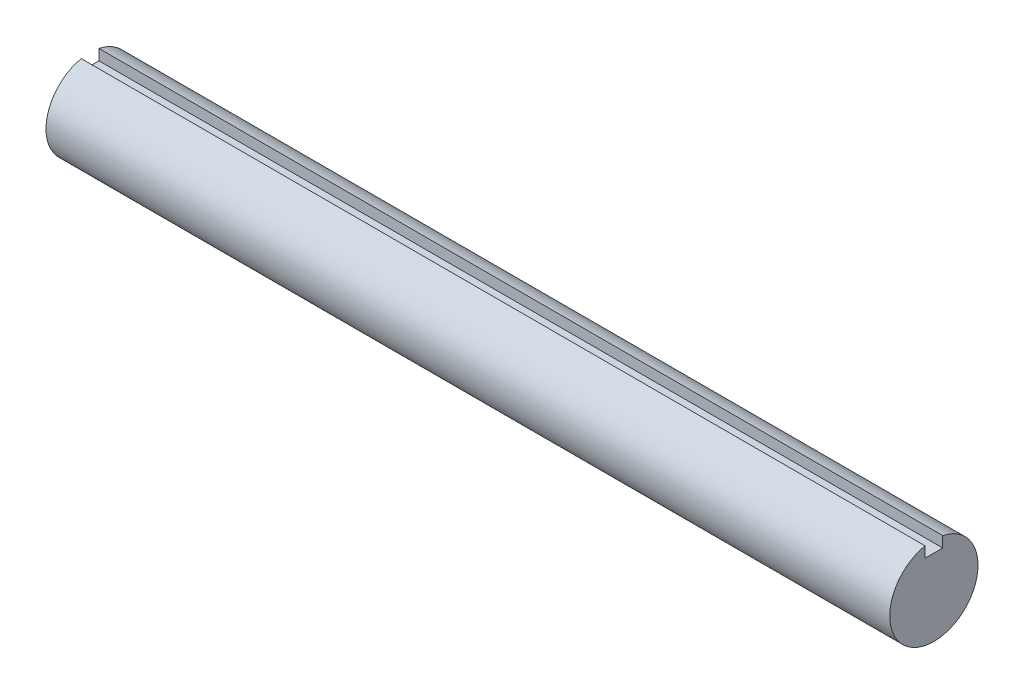
ISO-10303-21;
HEADER;
FILE_DESCRIPTION(('STEP AP214'),'2;1');
FILE_NAME('part.step','',(''),(''),'','','');
FILE_SCHEMA(('AUTOMOTIVE_DESIGN { 1 0 10303 214 1 1 1 1 }'));
ENDSEC;
DATA;
#1=APPLICATION_CONTEXT('core data for automotive mechanical design processes');
#2=APPLICATION_PROTOCOL_DEFINITION('international standard','automotive_design',2000,#1);
#3=PRODUCT_CONTEXT('',#1,'mechanical');
#4=PRODUCT('Part','Part','',(#3));
#5=PRODUCT_RELATED_PRODUCT_CATEGORY('part','',(#4));
#6=PRODUCT_DEFINITION_FORMATION('','',#4);
#7=PRODUCT_DEFINITION_CONTEXT('part definition',#1,'design');
#8=PRODUCT_DEFINITION('design','',#6,#7);
#9=PRODUCT_DEFINITION_SHAPE('','',#8);
#10=(LENGTH_UNIT() NAMED_UNIT(*) SI_UNIT(.MILLI.,.METRE.));
#11=(NAMED_UNIT(*) PLANE_ANGLE_UNIT() SI_UNIT($,.RADIAN.));
#12=(NAMED_UNIT(*) SI_UNIT($,.STERADIAN.) SOLID_ANGLE_UNIT());
#13=UNCERTAINTY_MEASURE_WITH_UNIT(LENGTH_MEASURE(1.E-05),#10,'distance_accuracy_value','');
#14=(GEOMETRIC_REPRESENTATION_CONTEXT(3) GLOBAL_UNCERTAINTY_ASSIGNED_CONTEXT((#13)) GLOBAL_UNIT_ASSIGNED_CONTEXT((#10,
#11,#12)) REPRESENTATION_CONTEXT('',''));
#15=CARTESIAN_POINT('',(0.,0.,0.));
#16=DIRECTION('',(0.,0.,1.));
#17=DIRECTION('',(1.,0.,0.));
#18=AXIS2_PLACEMENT_3D('',#15,#16,#17);
#19=CARTESIAN_POINT('',(127.,0.,0.));
#20=DIRECTION('',(-1.,0.,0.));
#21=DIRECTION('',(0.,0.,1.));
#22=AXIS2_PLACEMENT_3D('',#19,#20,#21);
#23=CYLINDRICAL_SURFACE('',#22,6.639);
#24=CARTESIAN_POINT('',(0.,0.,0.));
#25=DIRECTION('',(1.,0.,0.));
#26=DIRECTION('',(0.,0.,-1.));
#27=AXIS2_PLACEMENT_3D('',#24,#25,#26);
#28=CIRCLE('',#27,6.639);
#29=CARTESIAN_POINT('',(0.,6.50421094368871,1.331));
#30=VERTEX_POINT('',#29);
#31=CARTESIAN_POINT('',(0.,6.50421094368871,-1.331));
#32=VERTEX_POINT('',#31);
#33=EDGE_CURVE('E96',#30,#32,#28,.T.);
#34=ORIENTED_EDGE('',*,*,#33,.T.);
#35=DIRECTION('',(-1.,0.,0.));
#36=VECTOR('',#35,1.);
#37=CARTESIAN_POINT('',(127.,6.50421094368871,-1.331));
#38=LINE('',#37,#36);
#39=CARTESIAN_POINT('',(127.,6.50421094368871,-1.331));
#40=VERTEX_POINT('',#39);
#41=EDGE_CURVE('E11',#40,#32,#38,.T.);
#42=ORIENTED_EDGE('',*,*,#41,.F.);
#43=CARTESIAN_POINT('',(127.,0.,0.));
#44=DIRECTION('',(1.,0.,0.));
#45=DIRECTION('',(0.,0.,-1.));
#46=AXIS2_PLACEMENT_3D('',#43,#44,#45);
#47=CIRCLE('',#46,6.639);
#48=CARTESIAN_POINT('',(127.,6.50421094368871,1.331));
#49=VERTEX_POINT('',#48);
#50=EDGE_CURVE('E84',#49,#40,#47,.T.);
#51=ORIENTED_EDGE('',*,*,#50,.F.);
#52=DIRECTION('',(-1.,0.,0.));
#53=VECTOR('',#52,1.);
#54=CARTESIAN_POINT('',(127.,6.50421094368871,1.331));
#55=LINE('',#54,#53);
#56=EDGE_CURVE('E92',#49,#30,#55,.T.);
#57=ORIENTED_EDGE('',*,*,#56,.T.);
#58=EDGE_LOOP('',(#34,#42,#51,#57));
#59=FACE_BOUND('',#58,.T.);
#60=ADVANCED_FACE('F33',(#59),#23,.T.);
#61=CARTESIAN_POINT('',(127.,4.88521094368871,-1.331));
#62=DIRECTION('',(0.,0.,-1.));
#63=DIRECTION('',(-1.,0.,0.));
#64=AXIS2_PLACEMENT_3D('',#61,#62,#63);
#65=PLANE('',#64);
#66=DIRECTION('',(0.,-1.,0.));
#67=VECTOR('',#66,1.);
#68=CARTESIAN_POINT('',(0.,4.88521094368871,-1.331));
#69=LINE('',#68,#67);
#70=CARTESIAN_POINT('',(0.,4.88521094368871,-1.331));
#71=VERTEX_POINT('',#70);
#72=EDGE_CURVE('E88',#32,#71,#69,.T.);
#73=ORIENTED_EDGE('',*,*,#72,.T.);
#74=DIRECTION('',(-1.,0.,0.));
#75=VECTOR('',#74,1.);
#76=CARTESIAN_POINT('',(127.,4.88521094368871,-1.331));
#77=LINE('',#76,#75);
#78=CARTESIAN_POINT('',(127.,4.88521094368871,-1.331));
#79=VERTEX_POINT('',#78);
#80=EDGE_CURVE('E41',#79,#71,#77,.T.);
#81=ORIENTED_EDGE('',*,*,#80,.F.);
#82=DIRECTION('',(0.,-1.,0.));
#83=VECTOR('',#82,1.);
#84=CARTESIAN_POINT('',(127.,4.88521094368871,-1.331));
#85=LINE('',#84,#83);
#86=EDGE_CURVE('E79',#40,#79,#85,.T.);
#87=ORIENTED_EDGE('',*,*,#86,.F.);
#88=ORIENTED_EDGE('',*,*,#41,.T.);
#89=EDGE_LOOP('',(#73,#81,#87,#88));
#90=FACE_BOUND('',#89,.T.);
#91=ADVANCED_FACE('F87',(#90),#65,.F.);
#92=CARTESIAN_POINT('',(127.,4.88521094368871,1.331));
#93=DIRECTION('',(0.,-1.,0.));
#94=DIRECTION('',(0.,0.,-1.));
#95=AXIS2_PLACEMENT_3D('',#92,#93,#94);
#96=PLANE('',#95);
#97=DIRECTION('',(0.,0.,1.));
#98=VECTOR('',#97,1.);
#99=CARTESIAN_POINT('',(0.,4.88521094368871,1.331));
#100=LINE('',#99,#98);
#101=CARTESIAN_POINT('',(0.,4.88521094368871,1.331));
#102=VERTEX_POINT('',#101);
#103=EDGE_CURVE('E66',#71,#102,#100,.T.);
#104=ORIENTED_EDGE('',*,*,#103,.T.);
#105=DIRECTION('',(-1.,0.,0.));
#106=VECTOR('',#105,1.);
#107=CARTESIAN_POINT('',(127.,4.88521094368871,1.331));
#108=LINE('',#107,#106);
#109=CARTESIAN_POINT('',(127.,4.88521094368871,1.331));
#110=VERTEX_POINT('',#109);
#111=EDGE_CURVE('E89',#110,#102,#108,.T.);
#112=ORIENTED_EDGE('',*,*,#111,.F.);
#113=DIRECTION('',(0.,0.,1.));
#114=VECTOR('',#113,1.);
#115=CARTESIAN_POINT('',(127.,4.88521094368871,1.331));
#116=LINE('',#115,#114);
#117=EDGE_CURVE('E82',#79,#110,#116,.T.);
#118=ORIENTED_EDGE('',*,*,#117,.F.);
#119=ORIENTED_EDGE('',*,*,#80,.T.);
#120=EDGE_LOOP('',(#104,#112,#118,#119));
#121=FACE_BOUND('',#120,.T.);
#122=ADVANCED_FACE('F90',(#121),#96,.F.);
#123=CARTESIAN_POINT('',(127.,6.50421094368871,1.331));
#124=DIRECTION('',(0.,0.,1.));
#125=DIRECTION('',(0.,-1.,0.));
#126=AXIS2_PLACEMENT_3D('',#123,#124,#125);
#127=PLANE('',#126);
#128=DIRECTION('',(0.,1.,0.));
#129=VECTOR('',#128,1.);
#130=CARTESIAN_POINT('',(0.,6.50421094368871,1.331));
#131=LINE('',#130,#129);
#132=EDGE_CURVE('E72',#102,#30,#131,.T.);
#133=ORIENTED_EDGE('',*,*,#132,.T.);
#134=ORIENTED_EDGE('',*,*,#56,.F.);
#135=DIRECTION('',(0.,1.,0.));
#136=VECTOR('',#135,1.);
#137=CARTESIAN_POINT('',(127.,6.50421094368871,1.331));
#138=LINE('',#137,#136);
#139=EDGE_CURVE('E49',#110,#49,#138,.T.);
#140=ORIENTED_EDGE('',*,*,#139,.F.);
#141=ORIENTED_EDGE('',*,*,#111,.T.);
#142=EDGE_LOOP('',(#133,#134,#140,#141));
#143=FACE_BOUND('',#142,.T.);
#144=ADVANCED_FACE('F103',(#143),#127,.F.);
#145=CARTESIAN_POINT('',(127.,0.,0.));
#146=DIRECTION('',(1.,0.,0.));
#147=DIRECTION('',(0.,0.,-1.));
#148=AXIS2_PLACEMENT_3D('',#145,#146,#147);
#149=PLANE('',#148);
#150=ORIENTED_EDGE('',*,*,#50,.T.);
#151=ORIENTED_EDGE('',*,*,#86,.T.);
#152=ORIENTED_EDGE('',*,*,#117,.T.);
#153=ORIENTED_EDGE('',*,*,#139,.T.);
#154=EDGE_LOOP('',(#150,#151,#152,#153));
#155=FACE_BOUND('',#154,.T.);
#156=ADVANCED_FACE('F80',(#155),#149,.T.);
#157=CARTESIAN_POINT('',(0.,0.,0.));
#158=DIRECTION('',(1.,0.,0.));
#159=DIRECTION('',(0.,0.,-1.));
#160=AXIS2_PLACEMENT_3D('',#157,#158,#159);
#161=PLANE('',#160);
#162=ORIENTED_EDGE('',*,*,#33,.F.);
#163=ORIENTED_EDGE('',*,*,#132,.F.);
#164=ORIENTED_EDGE('',*,*,#103,.F.);
#165=ORIENTED_EDGE('',*,*,#72,.F.);
#166=EDGE_LOOP('',(#162,#163,#164,#165));
#167=FACE_BOUND('',#166,.T.);
#168=ADVANCED_FACE('F106',(#167),#161,.F.);
#169=CLOSED_SHELL('',(#60,#91,#122,#144,#156,#168));
#170=MANIFOLD_SOLID_BREP('B2',#169);
#171=ADVANCED_BREP_SHAPE_REPRESENTATION('',(#18,#170),#14);
#172=SHAPE_DEFINITION_REPRESENTATION(#9,#171);
ENDSEC;
END-ISO-10303-21;
